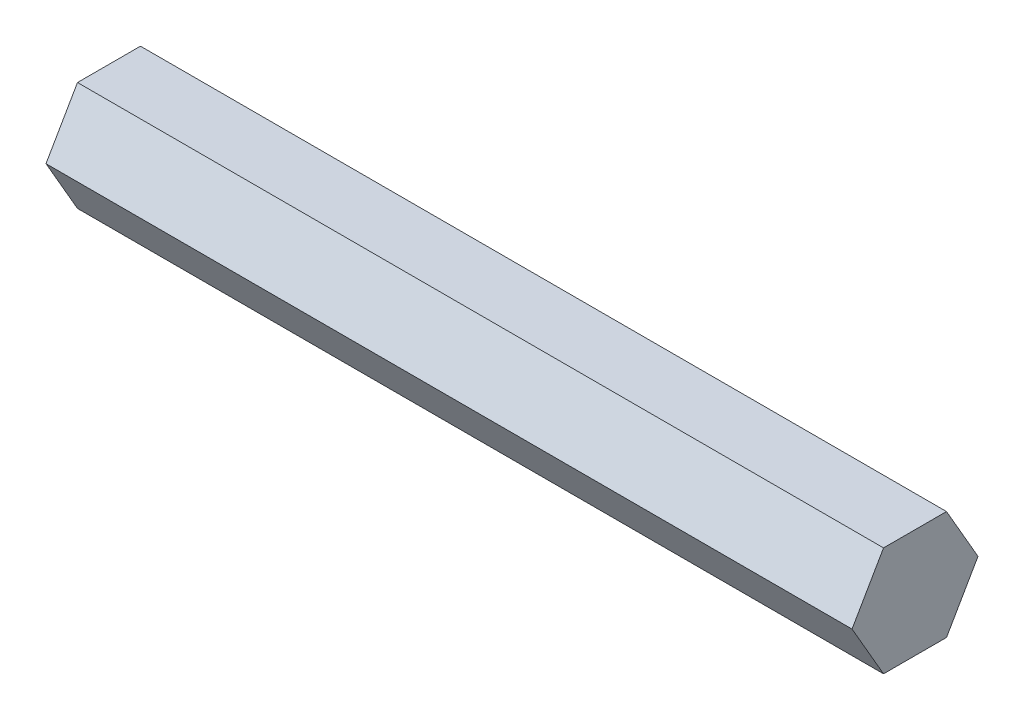
ISO-10303-21;
HEADER;
FILE_DESCRIPTION(('STEP AP214'),'2;1');
FILE_NAME('part.step','',(''),(''),'','','');
FILE_SCHEMA(('AUTOMOTIVE_DESIGN { 1 0 10303 214 1 1 1 1 }'));
ENDSEC;
DATA;
#1=APPLICATION_CONTEXT('core data for automotive mechanical design processes');
#2=APPLICATION_PROTOCOL_DEFINITION('international standard','automotive_design',2000,#1);
#3=PRODUCT_CONTEXT('',#1,'mechanical');
#4=PRODUCT('Part','Part','',(#3));
#5=PRODUCT_RELATED_PRODUCT_CATEGORY('part','',(#4));
#6=PRODUCT_DEFINITION_FORMATION('','',#4);
#7=PRODUCT_DEFINITION_CONTEXT('part definition',#1,'design');
#8=PRODUCT_DEFINITION('design','',#6,#7);
#9=PRODUCT_DEFINITION_SHAPE('','',#8);
#10=(LENGTH_UNIT() NAMED_UNIT(*) SI_UNIT(.MILLI.,.METRE.));
#11=(NAMED_UNIT(*) PLANE_ANGLE_UNIT() SI_UNIT($,.RADIAN.));
#12=(NAMED_UNIT(*) SI_UNIT($,.STERADIAN.) SOLID_ANGLE_UNIT());
#13=UNCERTAINTY_MEASURE_WITH_UNIT(LENGTH_MEASURE(1.E-05),#10,'distance_accuracy_value','');
#14=(GEOMETRIC_REPRESENTATION_CONTEXT(3) GLOBAL_UNCERTAINTY_ASSIGNED_CONTEXT((#13)) GLOBAL_UNIT_ASSIGNED_CONTEXT((#10,
#11,#12)) REPRESENTATION_CONTEXT('',''));
#15=CARTESIAN_POINT('',(0.,0.,0.));
#16=DIRECTION('',(0.,0.,1.));
#17=DIRECTION('',(1.,0.,0.));
#18=AXIS2_PLACEMENT_3D('',#15,#16,#17);
#19=CARTESIAN_POINT('',(93.8499999999999,-6.34999999999996,-3.6661742093542));
#20=DIRECTION('',(0.,0.499999999999995,0.866025403784441));
#21=DIRECTION('',(0.,-0.866025403784442,0.499999999999995));
#22=AXIS2_PLACEMENT_3D('',#19,#20,#21);
#23=PLANE('',#22);
#24=DIRECTION('',(0.,0.866025403784442,-0.499999999999995));
#25=VECTOR('',#24,1.);
#26=CARTESIAN_POINT('',(0.,-6.34999999999996,-3.6661742093542));
#27=LINE('',#26,#25);
#28=CARTESIAN_POINT('',(0.,-6.34999999999996,-3.6661742093542));
#29=VERTEX_POINT('',#28);
#30=CARTESIAN_POINT('',(0.,0.,-7.33234841870825));
#31=VERTEX_POINT('',#30);
#32=EDGE_CURVE('E121',#29,#31,#27,.T.);
#33=ORIENTED_EDGE('',*,*,#32,.T.);
#34=DIRECTION('',(-1.,0.,0.));
#35=VECTOR('',#34,1.);
#36=CARTESIAN_POINT('',(93.8499999999999,0.,-7.33234841870825));
#37=LINE('',#36,#35);
#38=CARTESIAN_POINT('',(93.8499999999999,0.,-7.33234841870825));
#39=VERTEX_POINT('',#38);
#40=EDGE_CURVE('E11',#39,#31,#37,.T.);
#41=ORIENTED_EDGE('',*,*,#40,.F.);
#42=DIRECTION('',(0.,0.866025403784442,-0.499999999999995));
#43=VECTOR('',#42,1.);
#44=CARTESIAN_POINT('',(93.8499999999999,-6.34999999999996,-3.6661742093542));
#45=LINE('',#44,#43);
#46=CARTESIAN_POINT('',(93.8499999999999,-6.34999999999996,-3.6661742093542));
#47=VERTEX_POINT('',#46);
#48=EDGE_CURVE('E135',#47,#39,#45,.T.);
#49=ORIENTED_EDGE('',*,*,#48,.F.);
#50=DIRECTION('',(-1.,0.,0.));
#51=VECTOR('',#50,1.);
#52=CARTESIAN_POINT('',(93.8499999999999,-6.34999999999996,-3.6661742093542));
#53=LINE('',#52,#51);
#54=EDGE_CURVE('E118',#47,#29,#53,.T.);
#55=ORIENTED_EDGE('',*,*,#54,.T.);
#56=EDGE_LOOP('',(#33,#41,#49,#55));
#57=FACE_BOUND('',#56,.T.);
#58=ADVANCED_FACE('F39',(#57),#23,.F.);
#59=CARTESIAN_POINT('',(93.8499999999999,0.,-7.33234841870825));
#60=DIRECTION('',(0.,-0.500000000000001,0.866025403784438));
#61=DIRECTION('',(0.,-0.866025403784438,-0.500000000000001));
#62=AXIS2_PLACEMENT_3D('',#59,#60,#61);
#63=PLANE('',#62);
#64=DIRECTION('',(0.,0.866025403784438,0.500000000000001));
#65=VECTOR('',#64,1.);
#66=CARTESIAN_POINT('',(0.,0.,-7.33234841870825));
#67=LINE('',#66,#65);
#68=CARTESIAN_POINT('',(0.,6.35000000000001,-3.66617420935411));
#69=VERTEX_POINT('',#68);
#70=EDGE_CURVE('E127',#31,#69,#67,.T.);
#71=ORIENTED_EDGE('',*,*,#70,.T.);
#72=DIRECTION('',(-1.,0.,0.));
#73=VECTOR('',#72,1.);
#74=CARTESIAN_POINT('',(93.8499999999999,6.35000000000001,-3.66617420935411));
#75=LINE('',#74,#73);
#76=CARTESIAN_POINT('',(93.8499999999999,6.35000000000001,-3.66617420935411));
#77=VERTEX_POINT('',#76);
#78=EDGE_CURVE('E50',#77,#69,#75,.T.);
#79=ORIENTED_EDGE('',*,*,#78,.F.);
#80=DIRECTION('',(0.,0.866025403784438,0.500000000000001));
#81=VECTOR('',#80,1.);
#82=CARTESIAN_POINT('',(93.8499999999999,0.,-7.33234841870825));
#83=LINE('',#82,#81);
#84=EDGE_CURVE('E95',#39,#77,#83,.T.);
#85=ORIENTED_EDGE('',*,*,#84,.F.);
#86=ORIENTED_EDGE('',*,*,#40,.T.);
#87=EDGE_LOOP('',(#71,#79,#85,#86));
#88=FACE_BOUND('',#87,.T.);
#89=ADVANCED_FACE('F160',(#88),#63,.F.);
#90=CARTESIAN_POINT('',(93.8499999999999,6.35000000000001,-3.66617420935411));
#91=DIRECTION('',(0.,-1.,0.));
#92=DIRECTION('',(0.,0.,-1.));
#93=AXIS2_PLACEMENT_3D('',#90,#91,#92);
#94=PLANE('',#93);
#95=DIRECTION('',(0.,0.,1.));
#96=VECTOR('',#95,1.);
#97=CARTESIAN_POINT('',(0.,6.35000000000001,-3.66617420935411));
#98=LINE('',#97,#96);
#99=CARTESIAN_POINT('',(0.,6.34999999999999,3.66617420935415));
#100=VERTEX_POINT('',#99);
#101=EDGE_CURVE('E126',#69,#100,#98,.T.);
#102=ORIENTED_EDGE('',*,*,#101,.T.);
#103=DIRECTION('',(-1.,0.,0.));
#104=VECTOR('',#103,1.);
#105=CARTESIAN_POINT('',(93.8499999999999,6.34999999999999,3.66617420935415));
#106=LINE('',#105,#104);
#107=CARTESIAN_POINT('',(93.8499999999999,6.34999999999999,3.66617420935415));
#108=VERTEX_POINT('',#107);
#109=EDGE_CURVE('E111',#108,#100,#106,.T.);
#110=ORIENTED_EDGE('',*,*,#109,.F.);
#111=DIRECTION('',(0.,0.,1.));
#112=VECTOR('',#111,1.);
#113=CARTESIAN_POINT('',(93.8499999999999,6.35000000000001,-3.66617420935411));
#114=LINE('',#113,#112);
#115=EDGE_CURVE('E104',#77,#108,#114,.T.);
#116=ORIENTED_EDGE('',*,*,#115,.F.);
#117=ORIENTED_EDGE('',*,*,#78,.T.);
#118=EDGE_LOOP('',(#102,#110,#116,#117));
#119=FACE_BOUND('',#118,.T.);
#120=ADVANCED_FACE('F139',(#119),#94,.F.);
#121=CARTESIAN_POINT('',(93.8499999999999,6.34999999999999,3.66617420935415));
#122=DIRECTION('',(0.,-0.499999999999995,-0.866025403784442));
#123=DIRECTION('',(0.,0.866025403784442,-0.499999999999995));
#124=AXIS2_PLACEMENT_3D('',#121,#122,#123);
#125=PLANE('',#124);
#126=DIRECTION('',(0.,-0.866025403784442,0.499999999999995));
#127=VECTOR('',#126,1.);
#128=CARTESIAN_POINT('',(0.,6.34999999999999,3.66617420935415));
#129=LINE('',#128,#127);
#130=CARTESIAN_POINT('',(0.,0.,7.33234841870825));
#131=VERTEX_POINT('',#130);
#132=EDGE_CURVE('E114',#100,#131,#129,.T.);
#133=ORIENTED_EDGE('',*,*,#132,.T.);
#134=DIRECTION('',(-1.,0.,0.));
#135=VECTOR('',#134,1.);
#136=CARTESIAN_POINT('',(93.8499999999999,0.,7.33234841870825));
#137=LINE('',#136,#135);
#138=CARTESIAN_POINT('',(93.8499999999999,0.,7.33234841870825));
#139=VERTEX_POINT('',#138);
#140=EDGE_CURVE('E109',#139,#131,#137,.T.);
#141=ORIENTED_EDGE('',*,*,#140,.F.);
#142=DIRECTION('',(0.,-0.866025403784442,0.499999999999995));
#143=VECTOR('',#142,1.);
#144=CARTESIAN_POINT('',(93.8499999999999,6.34999999999999,3.66617420935415));
#145=LINE('',#144,#143);
#146=EDGE_CURVE('E97',#108,#139,#145,.T.);
#147=ORIENTED_EDGE('',*,*,#146,.F.);
#148=ORIENTED_EDGE('',*,*,#109,.T.);
#149=EDGE_LOOP('',(#133,#141,#147,#148));
#150=FACE_BOUND('',#149,.T.);
#151=ADVANCED_FACE('F112',(#150),#125,.F.);
#152=CARTESIAN_POINT('',(93.8499999999999,0.,7.33234841870825));
#153=DIRECTION('',(0.,0.500000000000007,-0.866025403784435));
#154=DIRECTION('',(0.,0.866025403784435,0.500000000000007));
#155=AXIS2_PLACEMENT_3D('',#152,#153,#154);
#156=PLANE('',#155);
#157=DIRECTION('',(0.,-0.866025403784434,-0.500000000000007));
#158=VECTOR('',#157,1.);
#159=CARTESIAN_POINT('',(0.,0.,7.33234841870825));
#160=LINE('',#159,#158);
#161=CARTESIAN_POINT('',(0.,-6.35000000000004,3.66617420935407));
#162=VERTEX_POINT('',#161);
#163=EDGE_CURVE('E80',#131,#162,#160,.T.);
#164=ORIENTED_EDGE('',*,*,#163,.T.);
#165=DIRECTION('',(-1.,0.,0.));
#166=VECTOR('',#165,1.);
#167=CARTESIAN_POINT('',(93.8499999999999,-6.35000000000004,3.66617420935407));
#168=LINE('',#167,#166);
#169=CARTESIAN_POINT('',(93.8499999999999,-6.35000000000004,3.66617420935407));
#170=VERTEX_POINT('',#169);
#171=EDGE_CURVE('E113',#170,#162,#168,.T.);
#172=ORIENTED_EDGE('',*,*,#171,.F.);
#173=DIRECTION('',(0.,-0.866025403784434,-0.500000000000007));
#174=VECTOR('',#173,1.);
#175=CARTESIAN_POINT('',(93.8499999999999,0.,7.33234841870825));
#176=LINE('',#175,#174);
#177=EDGE_CURVE('E103',#139,#170,#176,.T.);
#178=ORIENTED_EDGE('',*,*,#177,.F.);
#179=ORIENTED_EDGE('',*,*,#140,.T.);
#180=EDGE_LOOP('',(#164,#172,#178,#179));
#181=FACE_BOUND('',#180,.T.);
#182=ADVANCED_FACE('F116',(#181),#156,.F.);
#183=CARTESIAN_POINT('',(93.8499999999999,-6.35000000000004,3.66617420935407));
#184=DIRECTION('',(0.,1.,0.));
#185=DIRECTION('',(0.,0.,1.));
#186=AXIS2_PLACEMENT_3D('',#183,#184,#185);
#187=PLANE('',#186);
#188=DIRECTION('',(0.,0.,-1.));
#189=VECTOR('',#188,1.);
#190=CARTESIAN_POINT('',(0.,-6.35000000000004,3.66617420935407));
#191=LINE('',#190,#189);
#192=EDGE_CURVE('E84',#162,#29,#191,.T.);
#193=ORIENTED_EDGE('',*,*,#192,.T.);
#194=ORIENTED_EDGE('',*,*,#54,.F.);
#195=DIRECTION('',(0.,0.,-1.));
#196=VECTOR('',#195,1.);
#197=CARTESIAN_POINT('',(93.8499999999999,-6.35000000000004,3.66617420935407));
#198=LINE('',#197,#196);
#199=EDGE_CURVE('E54',#170,#47,#198,.T.);
#200=ORIENTED_EDGE('',*,*,#199,.F.);
#201=ORIENTED_EDGE('',*,*,#171,.T.);
#202=EDGE_LOOP('',(#193,#194,#200,#201));
#203=FACE_BOUND('',#202,.T.);
#204=ADVANCED_FACE('F148',(#203),#187,.F.);
#205=CARTESIAN_POINT('',(93.8499999999999,0.,0.));
#206=DIRECTION('',(1.,0.,0.));
#207=DIRECTION('',(0.,0.,-1.));
#208=AXIS2_PLACEMENT_3D('',#205,#206,#207);
#209=PLANE('',#208);
#210=ORIENTED_EDGE('',*,*,#48,.T.);
#211=ORIENTED_EDGE('',*,*,#84,.T.);
#212=ORIENTED_EDGE('',*,*,#115,.T.);
#213=ORIENTED_EDGE('',*,*,#146,.T.);
#214=ORIENTED_EDGE('',*,*,#177,.T.);
#215=ORIENTED_EDGE('',*,*,#199,.T.);
#216=EDGE_LOOP('',(#210,#211,#212,#213,#214,#215));
#217=FACE_BOUND('',#216,.T.);
#218=ADVANCED_FACE('F101',(#217),#209,.T.);
#219=CARTESIAN_POINT('',(0.,0.,0.));
#220=DIRECTION('',(1.,0.,0.));
#221=DIRECTION('',(0.,0.,-1.));
#222=AXIS2_PLACEMENT_3D('',#219,#220,#221);
#223=PLANE('',#222);
#224=ORIENTED_EDGE('',*,*,#32,.F.);
#225=ORIENTED_EDGE('',*,*,#192,.F.);
#226=ORIENTED_EDGE('',*,*,#163,.F.);
#227=ORIENTED_EDGE('',*,*,#132,.F.);
#228=ORIENTED_EDGE('',*,*,#101,.F.);
#229=ORIENTED_EDGE('',*,*,#70,.F.);
#230=EDGE_LOOP('',(#224,#225,#226,#227,#228,#229));
#231=FACE_BOUND('',#230,.T.);
#232=ADVANCED_FACE('F142',(#231),#223,.F.);
#233=CLOSED_SHELL('',(#58,#89,#120,#151,#182,#204,#218,#232));
#234=MANIFOLD_SOLID_BREP('B2',#233);
#235=ADVANCED_BREP_SHAPE_REPRESENTATION('',(#18,#234),#14);
#236=SHAPE_DEFINITION_REPRESENTATION(#9,#235);
ENDSEC;
END-ISO-10303-21;
